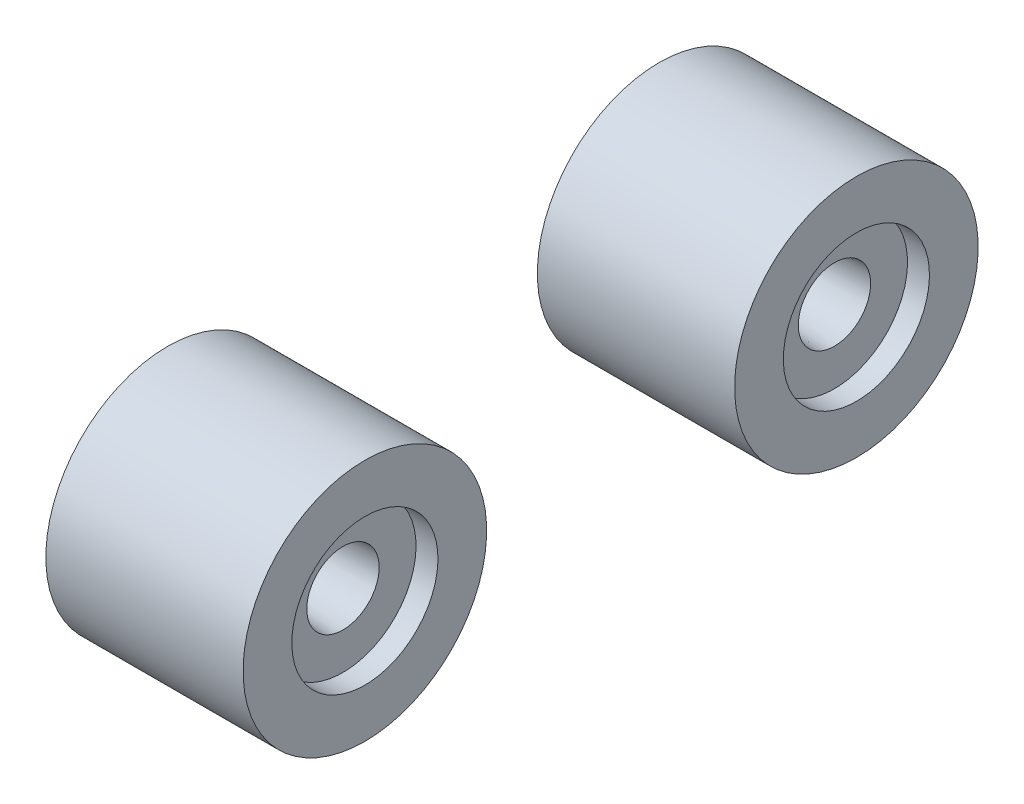
ISO-10303-21;
HEADER;
FILE_DESCRIPTION(('STEP AP214'),'2;1');
FILE_NAME('part.step','',(''),(''),'','','');
FILE_SCHEMA(('AUTOMOTIVE_DESIGN { 1 0 10303 214 1 1 1 1 }'));
ENDSEC;
DATA;
#1=APPLICATION_CONTEXT('core data for automotive mechanical design processes');
#2=APPLICATION_PROTOCOL_DEFINITION('international standard','automotive_design',2000,#1);
#3=PRODUCT_CONTEXT('',#1,'mechanical');
#4=PRODUCT('Part','Part','',(#3));
#5=PRODUCT_RELATED_PRODUCT_CATEGORY('part','',(#4));
#6=PRODUCT_DEFINITION_FORMATION('','',#4);
#7=PRODUCT_DEFINITION_CONTEXT('part definition',#1,'design');
#8=PRODUCT_DEFINITION('design','',#6,#7);
#9=PRODUCT_DEFINITION_SHAPE('','',#8);
#10=(LENGTH_UNIT() NAMED_UNIT(*) SI_UNIT(.MILLI.,.METRE.));
#11=(NAMED_UNIT(*) PLANE_ANGLE_UNIT() SI_UNIT($,.RADIAN.));
#12=(NAMED_UNIT(*) SI_UNIT($,.STERADIAN.) SOLID_ANGLE_UNIT());
#13=UNCERTAINTY_MEASURE_WITH_UNIT(LENGTH_MEASURE(1.E-05),#10,'distance_accuracy_value','');
#14=(GEOMETRIC_REPRESENTATION_CONTEXT(3) GLOBAL_UNCERTAINTY_ASSIGNED_CONTEXT((#13)) GLOBAL_UNIT_ASSIGNED_CONTEXT((#10,
#11,#12)) REPRESENTATION_CONTEXT('',''));
#15=CARTESIAN_POINT('',(0.,0.,0.));
#16=DIRECTION('',(0.,0.,1.));
#17=DIRECTION('',(1.,0.,0.));
#18=AXIS2_PLACEMENT_3D('',#15,#16,#17);
#19=CARTESIAN_POINT('',(8.255,0.,50.4527690620356));
#20=DIRECTION('',(1.,0.,0.));
#21=DIRECTION('',(0.,1.,0.));
#22=AXIS2_PLACEMENT_3D('',#19,#20,#21);
#23=PLANE('',#22);
#24=CARTESIAN_POINT('',(8.255,0.,50.4527690620356));
#25=DIRECTION('',(-1.,0.,0.));
#26=DIRECTION('',(0.,-1.,0.));
#27=AXIS2_PLACEMENT_3D('',#24,#25,#26);
#28=CIRCLE('',#27,3.71375);
#29=CARTESIAN_POINT('',(8.255,-3.71375,50.4527690620356));
#30=VERTEX_POINT('',#29);
#31=EDGE_CURVE('E61',#30,#30,#28,.T.);
#32=ORIENTED_EDGE('',*,*,#31,.F.);
#33=EDGE_LOOP('',(#32));
#34=FACE_BOUND('',#33,.T.);
#35=CARTESIAN_POINT('',(8.255,0.,50.4527690620356));
#36=DIRECTION('',(-1.,0.,0.));
#37=DIRECTION('',(0.,-1.,0.));
#38=AXIS2_PLACEMENT_3D('',#35,#36,#37);
#39=CIRCLE('',#38,12.5);
#40=CARTESIAN_POINT('',(8.255,-12.5,50.4527690620356));
#41=VERTEX_POINT('',#40);
#42=EDGE_CURVE('E11',#41,#41,#39,.T.);
#43=ORIENTED_EDGE('',*,*,#42,.T.);
#44=EDGE_LOOP('',(#43));
#45=FACE_BOUND('',#44,.T.);
#46=ADVANCED_FACE('F49',(#34,#45),#23,.F.);
#47=CARTESIAN_POINT('',(8.255,0.,50.4527690620356));
#48=DIRECTION('',(-1.,0.,0.));
#49=DIRECTION('',(0.,-1.,0.));
#50=AXIS2_PLACEMENT_3D('',#47,#48,#49);
#51=CYLINDRICAL_SURFACE('',#50,12.5);
#52=ORIENTED_EDGE('',*,*,#42,.F.);
#53=EDGE_LOOP('',(#52));
#54=FACE_BOUND('',#53,.T.);
#55=CARTESIAN_POINT('',(28.505,0.,50.4527690620356));
#56=DIRECTION('',(1.,0.,0.));
#57=DIRECTION('',(0.,1.,0.));
#58=AXIS2_PLACEMENT_3D('',#55,#56,#57);
#59=CIRCLE('',#58,12.5);
#60=CARTESIAN_POINT('',(28.505,12.5,50.4527690620356));
#61=VERTEX_POINT('',#60);
#62=EDGE_CURVE('E76',#61,#61,#59,.T.);
#63=ORIENTED_EDGE('',*,*,#62,.F.);
#64=EDGE_LOOP('',(#63));
#65=FACE_BOUND('',#64,.T.);
#66=ADVANCED_FACE('F107',(#54,#65),#51,.T.);
#67=CARTESIAN_POINT('',(8.255,0.,50.4527690620356));
#68=DIRECTION('',(-1.,0.,0.));
#69=DIRECTION('',(0.,-1.,0.));
#70=AXIS2_PLACEMENT_3D('',#67,#68,#69);
#71=CONICAL_SURFACE('',#70,3.71375,0.05235987755983);
#72=CARTESIAN_POINT('',(15.8275,0.,50.4527690620356));
#73=DIRECTION('',(-1.,0.,0.));
#74=DIRECTION('',(0.,-1.,0.));
#75=AXIS2_PLACEMENT_3D('',#72,#73,#74);
#76=CIRCLE('',#75,3.31689209137917);
#77=CARTESIAN_POINT('',(15.8275,-3.31689209137917,50.4527690620356));
#78=VERTEX_POINT('',#77);
#79=EDGE_CURVE('E56',#78,#78,#76,.T.);
#80=ORIENTED_EDGE('',*,*,#79,.F.);
#81=EDGE_LOOP('',(#80));
#82=FACE_BOUND('',#81,.T.);
#83=ORIENTED_EDGE('',*,*,#31,.T.);
#84=EDGE_LOOP('',(#83));
#85=FACE_BOUND('',#84,.T.);
#86=ADVANCED_FACE('F103',(#82,#85),#71,.F.);
#87=CARTESIAN_POINT('',(15.8275,0.,50.4527690620356));
#88=DIRECTION('',(-1.,0.,0.));
#89=DIRECTION('',(0.,-1.,0.));
#90=AXIS2_PLACEMENT_3D('',#87,#88,#89);
#91=PLANE('',#90);
#92=ORIENTED_EDGE('',*,*,#79,.T.);
#93=EDGE_LOOP('',(#92));
#94=FACE_BOUND('',#93,.T.);
#95=ADVANCED_FACE('F94',(#94),#91,.T.);
#96=CARTESIAN_POINT('',(28.505,0.,50.4527690620356));
#97=DIRECTION('',(1.,0.,0.));
#98=DIRECTION('',(0.,1.,0.));
#99=AXIS2_PLACEMENT_3D('',#96,#97,#98);
#100=PLANE('',#99);
#101=ORIENTED_EDGE('',*,*,#62,.T.);
#102=EDGE_LOOP('',(#101));
#103=FACE_BOUND('',#102,.T.);
#104=CARTESIAN_POINT('',(28.505,0.,50.4527690620356));
#105=DIRECTION('',(1.,0.,0.));
#106=DIRECTION('',(0.,1.,0.));
#107=AXIS2_PLACEMENT_3D('',#104,#105,#106);
#108=CIRCLE('',#107,7.5);
#109=CARTESIAN_POINT('',(28.505,7.5,50.4527690620356));
#110=VERTEX_POINT('',#109);
#111=EDGE_CURVE('E80',#110,#110,#108,.T.);
#112=ORIENTED_EDGE('',*,*,#111,.F.);
#113=EDGE_LOOP('',(#112));
#114=FACE_BOUND('',#113,.T.);
#115=ADVANCED_FACE('F92',(#103,#114),#100,.T.);
#116=CARTESIAN_POINT('',(28.505,0.,50.4527690620356));
#117=DIRECTION('',(-1.,0.,0.));
#118=DIRECTION('',(0.,-1.,0.));
#119=AXIS2_PLACEMENT_3D('',#116,#117,#118);
#120=CYLINDRICAL_SURFACE('',#119,7.5);
#121=ORIENTED_EDGE('',*,*,#111,.T.);
#122=EDGE_LOOP('',(#121));
#123=FACE_BOUND('',#122,.T.);
#124=CARTESIAN_POINT('',(26.255,0.,50.4527690620356));
#125=DIRECTION('',(1.,0.,0.));
#126=DIRECTION('',(0.,1.,0.));
#127=AXIS2_PLACEMENT_3D('',#124,#125,#126);
#128=CIRCLE('',#127,7.5);
#129=CARTESIAN_POINT('',(26.255,7.5,50.4527690620356));
#130=VERTEX_POINT('',#129);
#131=EDGE_CURVE('E81',#130,#130,#128,.T.);
#132=ORIENTED_EDGE('',*,*,#131,.F.);
#133=EDGE_LOOP('',(#132));
#134=FACE_BOUND('',#133,.T.);
#135=ADVANCED_FACE('F89',(#123,#134),#120,.F.);
#136=CARTESIAN_POINT('',(19.1825,0.,50.4527690620356));
#137=DIRECTION('',(1.,0.,0.));
#138=DIRECTION('',(0.,0.,-1.));
#139=AXIS2_PLACEMENT_3D('',#136,#137,#138);
#140=PLANE('',#139);
#141=CARTESIAN_POINT('',(19.1825,0.,50.4527690620356));
#142=DIRECTION('',(1.,0.,0.));
#143=DIRECTION('',(0.,0.,-1.));
#144=AXIS2_PLACEMENT_3D('',#141,#142,#143);
#145=CIRCLE('',#144,3.34309598102069);
#146=CARTESIAN_POINT('',(19.1825,0.,47.1096730810149));
#147=VERTEX_POINT('',#146);
#148=EDGE_CURVE('E66',#147,#147,#145,.T.);
#149=ORIENTED_EDGE('',*,*,#148,.T.);
#150=EDGE_LOOP('',(#149));
#151=FACE_BOUND('',#150,.T.);
#152=ADVANCED_FACE('F101',(#151),#140,.T.);
#153=CARTESIAN_POINT('',(26.255,0.,50.4527690620356));
#154=DIRECTION('',(1.,0.,0.));
#155=DIRECTION('',(0.,0.,-1.));
#156=AXIS2_PLACEMENT_3D('',#153,#154,#155);
#157=CONICAL_SURFACE('',#156,3.71375,0.05235987755983);
#158=ORIENTED_EDGE('',*,*,#148,.F.);
#159=EDGE_LOOP('',(#158));
#160=FACE_BOUND('',#159,.T.);
#161=CARTESIAN_POINT('',(26.255,0.,50.4527690620356));
#162=DIRECTION('',(1.,0.,0.));
#163=DIRECTION('',(0.,0.,-1.));
#164=AXIS2_PLACEMENT_3D('',#161,#162,#163);
#165=CIRCLE('',#164,3.71375);
#166=CARTESIAN_POINT('',(26.255,0.,46.7390190620356));
#167=VERTEX_POINT('',#166);
#168=EDGE_CURVE('E72',#167,#167,#165,.T.);
#169=ORIENTED_EDGE('',*,*,#168,.T.);
#170=EDGE_LOOP('',(#169));
#171=FACE_BOUND('',#170,.T.);
#172=ADVANCED_FACE('F124',(#160,#171),#157,.F.);
#173=CARTESIAN_POINT('',(26.255,12.5,50.4527690620356));
#174=DIRECTION('',(-1.,0.,0.));
#175=DIRECTION('',(0.,-1.,0.));
#176=AXIS2_PLACEMENT_3D('',#173,#174,#175);
#177=PLANE('',#176);
#178=ORIENTED_EDGE('',*,*,#168,.F.);
#179=EDGE_LOOP('',(#178));
#180=FACE_BOUND('',#179,.T.);
#181=ORIENTED_EDGE('',*,*,#131,.T.);
#182=EDGE_LOOP('',(#181));
#183=FACE_BOUND('',#182,.T.);
#184=ADVANCED_FACE('F122',(#180,#183),#177,.F.);
#185=CLOSED_SHELL('',(#46,#66,#86,#95,#115,#135,#152,#172,#184));
#186=MANIFOLD_SOLID_BREP('B2',#185);
#187=CARTESIAN_POINT('',(8.255,0.,0.));
#188=DIRECTION('',(1.,0.,0.));
#189=DIRECTION('',(0.,1.,0.));
#190=AXIS2_PLACEMENT_3D('',#187,#188,#189);
#191=PLANE('',#190);
#192=CARTESIAN_POINT('',(8.255,0.,0.));
#193=DIRECTION('',(-1.,0.,0.));
#194=DIRECTION('',(0.,-1.,0.));
#195=AXIS2_PLACEMENT_3D('',#192,#193,#194);
#196=CIRCLE('',#195,3.71375);
#197=CARTESIAN_POINT('',(8.255,-3.71375,0.));
#198=VERTEX_POINT('',#197);
#199=EDGE_CURVE('E205',#198,#198,#196,.T.);
#200=ORIENTED_EDGE('',*,*,#199,.F.);
#201=EDGE_LOOP('',(#200));
#202=FACE_BOUND('',#201,.T.);
#203=CARTESIAN_POINT('',(8.255,0.,0.));
#204=DIRECTION('',(-1.,0.,0.));
#205=DIRECTION('',(0.,-1.,0.));
#206=AXIS2_PLACEMENT_3D('',#203,#204,#205);
#207=CIRCLE('',#206,12.5);
#208=CARTESIAN_POINT('',(8.255,-12.5,0.));
#209=VERTEX_POINT('',#208);
#210=EDGE_CURVE('E48',#209,#209,#207,.T.);
#211=ORIENTED_EDGE('',*,*,#210,.T.);
#212=EDGE_LOOP('',(#211));
#213=FACE_BOUND('',#212,.T.);
#214=ADVANCED_FACE('F195',(#202,#213),#191,.F.);
#215=CARTESIAN_POINT('',(8.255,0.,0.));
#216=DIRECTION('',(-1.,0.,0.));
#217=DIRECTION('',(0.,-1.,0.));
#218=AXIS2_PLACEMENT_3D('',#215,#216,#217);
#219=CYLINDRICAL_SURFACE('',#218,12.5);
#220=ORIENTED_EDGE('',*,*,#210,.F.);
#221=EDGE_LOOP('',(#220));
#222=FACE_BOUND('',#221,.T.);
#223=CARTESIAN_POINT('',(28.505,0.,0.));
#224=DIRECTION('',(1.,0.,0.));
#225=DIRECTION('',(0.,1.,0.));
#226=AXIS2_PLACEMENT_3D('',#223,#224,#225);
#227=CIRCLE('',#226,12.5);
#228=CARTESIAN_POINT('',(28.505,12.5,0.));
#229=VERTEX_POINT('',#228);
#230=EDGE_CURVE('E217',#229,#229,#227,.T.);
#231=ORIENTED_EDGE('',*,*,#230,.F.);
#232=EDGE_LOOP('',(#231));
#233=FACE_BOUND('',#232,.T.);
#234=ADVANCED_FACE('F245',(#222,#233),#219,.T.);
#235=CARTESIAN_POINT('',(8.255,0.,0.));
#236=DIRECTION('',(-1.,0.,0.));
#237=DIRECTION('',(0.,-1.,0.));
#238=AXIS2_PLACEMENT_3D('',#235,#236,#237);
#239=CONICAL_SURFACE('',#238,3.71375,0.05235987755983);
#240=CARTESIAN_POINT('',(15.8275,0.,0.));
#241=DIRECTION('',(-1.,0.,0.));
#242=DIRECTION('',(0.,-1.,0.));
#243=AXIS2_PLACEMENT_3D('',#240,#241,#242);
#244=CIRCLE('',#243,3.31689209137917);
#245=CARTESIAN_POINT('',(15.8275,-3.31689209137917,0.));
#246=VERTEX_POINT('',#245);
#247=EDGE_CURVE('E201',#246,#246,#244,.T.);
#248=ORIENTED_EDGE('',*,*,#247,.F.);
#249=EDGE_LOOP('',(#248));
#250=FACE_BOUND('',#249,.T.);
#251=ORIENTED_EDGE('',*,*,#199,.T.);
#252=EDGE_LOOP('',(#251));
#253=FACE_BOUND('',#252,.T.);
#254=ADVANCED_FACE('F241',(#250,#253),#239,.F.);
#255=CARTESIAN_POINT('',(15.8275,0.,0.));
#256=DIRECTION('',(-1.,0.,0.));
#257=DIRECTION('',(0.,-1.,0.));
#258=AXIS2_PLACEMENT_3D('',#255,#256,#257);
#259=PLANE('',#258);
#260=ORIENTED_EDGE('',*,*,#247,.T.);
#261=EDGE_LOOP('',(#260));
#262=FACE_BOUND('',#261,.T.);
#263=ADVANCED_FACE('F232',(#262),#259,.T.);
#264=CARTESIAN_POINT('',(28.505,0.,0.));
#265=DIRECTION('',(1.,0.,0.));
#266=DIRECTION('',(0.,1.,0.));
#267=AXIS2_PLACEMENT_3D('',#264,#265,#266);
#268=PLANE('',#267);
#269=ORIENTED_EDGE('',*,*,#230,.T.);
#270=EDGE_LOOP('',(#269));
#271=FACE_BOUND('',#270,.T.);
#272=CARTESIAN_POINT('',(28.505,0.,0.));
#273=DIRECTION('',(1.,0.,0.));
#274=DIRECTION('',(0.,1.,0.));
#275=AXIS2_PLACEMENT_3D('',#272,#273,#274);
#276=CIRCLE('',#275,7.5);
#277=CARTESIAN_POINT('',(28.505,7.5,0.));
#278=VERTEX_POINT('',#277);
#279=EDGE_CURVE('E220',#278,#278,#276,.T.);
#280=ORIENTED_EDGE('',*,*,#279,.F.);
#281=EDGE_LOOP('',(#280));
#282=FACE_BOUND('',#281,.T.);
#283=ADVANCED_FACE('F230',(#271,#282),#268,.T.);
#284=CARTESIAN_POINT('',(28.505,0.,0.));
#285=DIRECTION('',(-1.,0.,0.));
#286=DIRECTION('',(0.,-1.,0.));
#287=AXIS2_PLACEMENT_3D('',#284,#285,#286);
#288=CYLINDRICAL_SURFACE('',#287,7.5);
#289=ORIENTED_EDGE('',*,*,#279,.T.);
#290=EDGE_LOOP('',(#289));
#291=FACE_BOUND('',#290,.T.);
#292=CARTESIAN_POINT('',(26.255,0.,0.));
#293=DIRECTION('',(1.,0.,0.));
#294=DIRECTION('',(0.,1.,0.));
#295=AXIS2_PLACEMENT_3D('',#292,#293,#294);
#296=CIRCLE('',#295,7.5);
#297=CARTESIAN_POINT('',(26.255,7.5,0.));
#298=VERTEX_POINT('',#297);
#299=EDGE_CURVE('E221',#298,#298,#296,.T.);
#300=ORIENTED_EDGE('',*,*,#299,.F.);
#301=EDGE_LOOP('',(#300));
#302=FACE_BOUND('',#301,.T.);
#303=ADVANCED_FACE('F227',(#291,#302),#288,.F.);
#304=CARTESIAN_POINT('',(19.1825,0.,0.));
#305=DIRECTION('',(1.,0.,0.));
#306=DIRECTION('',(0.,0.,-1.));
#307=AXIS2_PLACEMENT_3D('',#304,#305,#306);
#308=PLANE('',#307);
#309=CARTESIAN_POINT('',(19.1825,0.,0.));
#310=DIRECTION('',(1.,0.,0.));
#311=DIRECTION('',(0.,0.,-1.));
#312=AXIS2_PLACEMENT_3D('',#309,#310,#311);
#313=CIRCLE('',#312,3.34309598102069);
#314=CARTESIAN_POINT('',(19.1825,0.,-3.34309598102069));
#315=VERTEX_POINT('',#314);
#316=EDGE_CURVE('E209',#315,#315,#313,.T.);
#317=ORIENTED_EDGE('',*,*,#316,.T.);
#318=EDGE_LOOP('',(#317));
#319=FACE_BOUND('',#318,.T.);
#320=ADVANCED_FACE('F239',(#319),#308,.T.);
#321=CARTESIAN_POINT('',(26.255,0.,0.));
#322=DIRECTION('',(1.,0.,0.));
#323=DIRECTION('',(0.,0.,-1.));
#324=AXIS2_PLACEMENT_3D('',#321,#322,#323);
#325=CONICAL_SURFACE('',#324,3.71375,0.05235987755983);
#326=ORIENTED_EDGE('',*,*,#316,.F.);
#327=EDGE_LOOP('',(#326));
#328=FACE_BOUND('',#327,.T.);
#329=CARTESIAN_POINT('',(26.255,0.,0.));
#330=DIRECTION('',(1.,0.,0.));
#331=DIRECTION('',(0.,0.,-1.));
#332=AXIS2_PLACEMENT_3D('',#329,#330,#331);
#333=CIRCLE('',#332,3.71375);
#334=CARTESIAN_POINT('',(26.255,0.,-3.71375));
#335=VERTEX_POINT('',#334);
#336=EDGE_CURVE('E214',#335,#335,#333,.T.);
#337=ORIENTED_EDGE('',*,*,#336,.T.);
#338=EDGE_LOOP('',(#337));
#339=FACE_BOUND('',#338,.T.);
#340=ADVANCED_FACE('F262',(#328,#339),#325,.F.);
#341=CARTESIAN_POINT('',(26.255,12.5,0.));
#342=DIRECTION('',(-1.,0.,0.));
#343=DIRECTION('',(0.,-1.,0.));
#344=AXIS2_PLACEMENT_3D('',#341,#342,#343);
#345=PLANE('',#344);
#346=ORIENTED_EDGE('',*,*,#336,.F.);
#347=EDGE_LOOP('',(#346));
#348=FACE_BOUND('',#347,.T.);
#349=ORIENTED_EDGE('',*,*,#299,.T.);
#350=EDGE_LOOP('',(#349));
#351=FACE_BOUND('',#350,.T.);
#352=ADVANCED_FACE('F260',(#348,#351),#345,.F.);
#353=CLOSED_SHELL('',(#214,#234,#254,#263,#283,#303,#320,#340,#352));
#354=MANIFOLD_SOLID_BREP('B6',#353);
#355=ADVANCED_BREP_SHAPE_REPRESENTATION('',(#18,#186,#354),#14);
#356=SHAPE_DEFINITION_REPRESENTATION(#9,#355);
ENDSEC;
END-ISO-10303-21;
